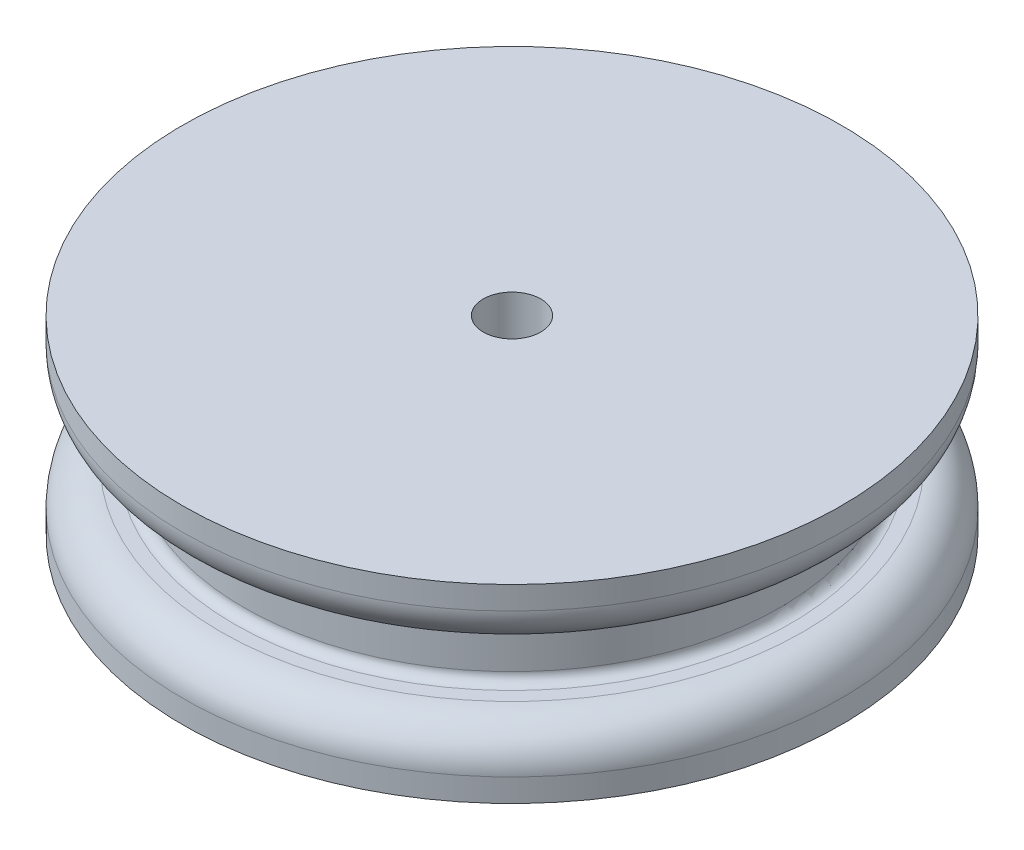
ISO-10303-21;
HEADER;
FILE_DESCRIPTION(('STEP AP214'),'2;1');
FILE_NAME('part.step','',(''),(''),'','','');
FILE_SCHEMA(('AUTOMOTIVE_DESIGN { 1 0 10303 214 1 1 1 1 }'));
ENDSEC;
DATA;
#1=APPLICATION_CONTEXT('core data for automotive mechanical design processes');
#2=APPLICATION_PROTOCOL_DEFINITION('international standard','automotive_design',2000,#1);
#3=PRODUCT_CONTEXT('',#1,'mechanical');
#4=PRODUCT('Part','Part','',(#3));
#5=PRODUCT_RELATED_PRODUCT_CATEGORY('part','',(#4));
#6=PRODUCT_DEFINITION_FORMATION('','',#4);
#7=PRODUCT_DEFINITION_CONTEXT('part definition',#1,'design');
#8=PRODUCT_DEFINITION('design','',#6,#7);
#9=PRODUCT_DEFINITION_SHAPE('','',#8);
#10=(LENGTH_UNIT() NAMED_UNIT(*) SI_UNIT(.MILLI.,.METRE.));
#11=(NAMED_UNIT(*) PLANE_ANGLE_UNIT() SI_UNIT($,.RADIAN.));
#12=(NAMED_UNIT(*) SI_UNIT($,.STERADIAN.) SOLID_ANGLE_UNIT());
#13=UNCERTAINTY_MEASURE_WITH_UNIT(LENGTH_MEASURE(1.E-05),#10,'distance_accuracy_value','');
#14=(GEOMETRIC_REPRESENTATION_CONTEXT(3) GLOBAL_UNCERTAINTY_ASSIGNED_CONTEXT((#13)) GLOBAL_UNIT_ASSIGNED_CONTEXT((#10,
#11,#12)) REPRESENTATION_CONTEXT('',''));
#15=CARTESIAN_POINT('',(0.,0.,0.));
#16=DIRECTION('',(0.,0.,1.));
#17=DIRECTION('',(1.,0.,0.));
#18=AXIS2_PLACEMENT_3D('',#15,#16,#17);
#19=CARTESIAN_POINT('',(0.,3.5,0.));
#20=DIRECTION('',(0.,-1.,0.));
#21=DIRECTION('',(0.,0.,-1.));
#22=AXIS2_PLACEMENT_3D('',#19,#20,#21);
#23=CYLINDRICAL_SURFACE('',#22,14.);
#24=CARTESIAN_POINT('',(0.,3.,0.));
#25=DIRECTION('',(0.,1.,0.));
#26=DIRECTION('',(0.,0.,1.));
#27=AXIS2_PLACEMENT_3D('',#24,#25,#26);
#28=CIRCLE('',#27,14.);
#29=CARTESIAN_POINT('',(0.,3.,14.));
#30=VERTEX_POINT('',#29);
#31=EDGE_CURVE('E44',#30,#30,#28,.F.);
#32=ORIENTED_EDGE('',*,*,#31,.T.);
#33=EDGE_LOOP('',(#32));
#34=FACE_BOUND('',#33,.T.);
#35=CARTESIAN_POINT('',(0.,0.5,0.));
#36=DIRECTION('',(0.,-1.,0.));
#37=DIRECTION('',(0.,0.,-1.));
#38=AXIS2_PLACEMENT_3D('',#35,#36,#37);
#39=CIRCLE('',#38,14.);
#40=CARTESIAN_POINT('',(0.,0.5,-14.));
#41=VERTEX_POINT('',#40);
#42=EDGE_CURVE('E48',#41,#41,#39,.F.);
#43=ORIENTED_EDGE('',*,*,#42,.T.);
#44=EDGE_LOOP('',(#43));
#45=FACE_BOUND('',#44,.T.);
#46=ADVANCED_FACE('F37',(#34,#45),#23,.T.);
#47=CARTESIAN_POINT('',(0.,6.7,0.));
#48=DIRECTION('',(0.,-1.,0.));
#49=DIRECTION('',(0.,0.,-1.));
#50=AXIS2_PLACEMENT_3D('',#47,#48,#49);
#51=CYLINDRICAL_SURFACE('',#50,17.2);
#52=CARTESIAN_POINT('',(0.,5.5,0.));
#53=DIRECTION('',(0.,1.,0.));
#54=DIRECTION('',(0.,0.,1.));
#55=AXIS2_PLACEMENT_3D('',#52,#53,#54);
#56=CIRCLE('',#55,17.2);
#57=CARTESIAN_POINT('',(0.,5.5,17.2));
#58=VERTEX_POINT('',#57);
#59=EDGE_CURVE('E66',#58,#58,#56,.T.);
#60=ORIENTED_EDGE('',*,*,#59,.T.);
#61=EDGE_LOOP('',(#60));
#62=FACE_BOUND('',#61,.T.);
#63=CARTESIAN_POINT('',(0.,6.7,0.));
#64=DIRECTION('',(0.,1.,0.));
#65=DIRECTION('',(0.,0.,1.));
#66=AXIS2_PLACEMENT_3D('',#63,#64,#65);
#67=CIRCLE('',#66,17.2);
#68=CARTESIAN_POINT('',(0.,6.7,17.2));
#69=VERTEX_POINT('',#68);
#70=EDGE_CURVE('E69',#69,#69,#67,.T.);
#71=ORIENTED_EDGE('',*,*,#70,.F.);
#72=EDGE_LOOP('',(#71));
#73=FACE_BOUND('',#72,.T.);
#74=ADVANCED_FACE('F114',(#62,#73),#51,.T.);
#75=CARTESIAN_POINT('',(0.,6.7,0.));
#76=DIRECTION('',(0.,1.,0.));
#77=DIRECTION('',(0.,0.,1.));
#78=AXIS2_PLACEMENT_3D('',#75,#76,#77);
#79=PLANE('',#78);
#80=CARTESIAN_POINT('',(0.,6.7,0.));
#81=DIRECTION('',(0.,-1.,0.));
#82=DIRECTION('',(0.,0.,-1.));
#83=AXIS2_PLACEMENT_3D('',#80,#81,#82);
#84=CIRCLE('',#83,1.5);
#85=CARTESIAN_POINT('',(0.,6.7,-1.5));
#86=VERTEX_POINT('',#85);
#87=EDGE_CURVE('E75',#86,#86,#84,.T.);
#88=ORIENTED_EDGE('',*,*,#87,.T.);
#89=EDGE_LOOP('',(#88));
#90=FACE_BOUND('',#89,.T.);
#91=ORIENTED_EDGE('',*,*,#70,.T.);
#92=EDGE_LOOP('',(#91));
#93=FACE_BOUND('',#92,.T.);
#94=ADVANCED_FACE('F82',(#90,#93),#79,.T.);
#95=CARTESIAN_POINT('',(0.,3.5,0.));
#96=DIRECTION('',(0.,1.,0.));
#97=DIRECTION('',(0.,0.,1.));
#98=AXIS2_PLACEMENT_3D('',#95,#96,#97);
#99=PLANE('',#98);
#100=CARTESIAN_POINT('',(0.,3.5,0.));
#101=DIRECTION('',(0.,1.,0.));
#102=DIRECTION('',(0.,0.,1.));
#103=AXIS2_PLACEMENT_3D('',#100,#101,#102);
#104=CIRCLE('',#103,14.5);
#105=CARTESIAN_POINT('',(0.,3.5,14.5));
#106=VERTEX_POINT('',#105);
#107=EDGE_CURVE('E52',#106,#106,#104,.T.);
#108=ORIENTED_EDGE('',*,*,#107,.T.);
#109=EDGE_LOOP('',(#108));
#110=FACE_BOUND('',#109,.T.);
#111=CARTESIAN_POINT('',(0.,3.5,0.));
#112=DIRECTION('',(0.,1.,0.));
#113=DIRECTION('',(0.,0.,1.));
#114=AXIS2_PLACEMENT_3D('',#111,#112,#113);
#115=CIRCLE('',#114,15.2);
#116=CARTESIAN_POINT('',(0.,3.5,15.2));
#117=VERTEX_POINT('',#116);
#118=EDGE_CURVE('E63',#117,#117,#115,.F.);
#119=ORIENTED_EDGE('',*,*,#118,.T.);
#120=EDGE_LOOP('',(#119));
#121=FACE_BOUND('',#120,.T.);
#122=ADVANCED_FACE('F101',(#110,#121),#99,.F.);
#123=CARTESIAN_POINT('',(0.,-3.2,0.));
#124=DIRECTION('',(0.,1.,0.));
#125=DIRECTION('',(0.,0.,1.));
#126=AXIS2_PLACEMENT_3D('',#123,#124,#125);
#127=CYLINDRICAL_SURFACE('',#126,17.2);
#128=CARTESIAN_POINT('',(0.,-2.,0.));
#129=DIRECTION('',(0.,-1.,0.));
#130=DIRECTION('',(0.,0.,-1.));
#131=AXIS2_PLACEMENT_3D('',#128,#129,#130);
#132=CIRCLE('',#131,17.2);
#133=CARTESIAN_POINT('',(0.,-2.,-17.2));
#134=VERTEX_POINT('',#133);
#135=EDGE_CURVE('E60',#134,#134,#132,.T.);
#136=ORIENTED_EDGE('',*,*,#135,.T.);
#137=EDGE_LOOP('',(#136));
#138=FACE_BOUND('',#137,.T.);
#139=CARTESIAN_POINT('',(0.,-3.2,0.));
#140=DIRECTION('',(0.,-1.,0.));
#141=DIRECTION('',(0.,0.,-1.));
#142=AXIS2_PLACEMENT_3D('',#139,#140,#141);
#143=CIRCLE('',#142,17.2);
#144=CARTESIAN_POINT('',(0.,-3.2,-17.2));
#145=VERTEX_POINT('',#144);
#146=EDGE_CURVE('E72',#145,#145,#143,.T.);
#147=ORIENTED_EDGE('',*,*,#146,.F.);
#148=EDGE_LOOP('',(#147));
#149=FACE_BOUND('',#148,.T.);
#150=ADVANCED_FACE('F96',(#138,#149),#127,.T.);
#151=CARTESIAN_POINT('',(0.,-3.2,0.));
#152=DIRECTION('',(0.,-1.,0.));
#153=DIRECTION('',(0.,0.,-1.));
#154=AXIS2_PLACEMENT_3D('',#151,#152,#153);
#155=PLANE('',#154);
#156=CARTESIAN_POINT('',(0.,-3.2,0.));
#157=DIRECTION('',(0.,-1.,0.));
#158=DIRECTION('',(0.,0.,-1.));
#159=AXIS2_PLACEMENT_3D('',#156,#157,#158);
#160=CIRCLE('',#159,1.5);
#161=CARTESIAN_POINT('',(0.,-3.2,-1.5));
#162=VERTEX_POINT('',#161);
#163=EDGE_CURVE('E76',#162,#162,#160,.T.);
#164=ORIENTED_EDGE('',*,*,#163,.F.);
#165=EDGE_LOOP('',(#164));
#166=FACE_BOUND('',#165,.T.);
#167=ORIENTED_EDGE('',*,*,#146,.T.);
#168=EDGE_LOOP('',(#167));
#169=FACE_BOUND('',#168,.T.);
#170=ADVANCED_FACE('F93',(#166,#169),#155,.T.);
#171=CARTESIAN_POINT('',(0.,0.,0.));
#172=DIRECTION('',(0.,-1.,0.));
#173=DIRECTION('',(0.,0.,-1.));
#174=AXIS2_PLACEMENT_3D('',#171,#172,#173);
#175=PLANE('',#174);
#176=CARTESIAN_POINT('',(0.,0.,0.));
#177=DIRECTION('',(0.,-1.,0.));
#178=DIRECTION('',(0.,0.,-1.));
#179=AXIS2_PLACEMENT_3D('',#176,#177,#178);
#180=CIRCLE('',#179,14.5);
#181=CARTESIAN_POINT('',(0.,0.,-14.5));
#182=VERTEX_POINT('',#181);
#183=EDGE_CURVE('E10',#182,#182,#180,.T.);
#184=ORIENTED_EDGE('',*,*,#183,.T.);
#185=EDGE_LOOP('',(#184));
#186=FACE_BOUND('',#185,.T.);
#187=CARTESIAN_POINT('',(0.,0.,0.));
#188=DIRECTION('',(0.,-1.,0.));
#189=DIRECTION('',(0.,0.,-1.));
#190=AXIS2_PLACEMENT_3D('',#187,#188,#189);
#191=CIRCLE('',#190,15.2);
#192=CARTESIAN_POINT('',(0.,0.,-15.2));
#193=VERTEX_POINT('',#192);
#194=EDGE_CURVE('E57',#193,#193,#191,.F.);
#195=ORIENTED_EDGE('',*,*,#194,.T.);
#196=EDGE_LOOP('',(#195));
#197=FACE_BOUND('',#196,.T.);
#198=ADVANCED_FACE('F89',(#186,#197),#175,.F.);
#199=CARTESIAN_POINT('',(0.,6.7,0.));
#200=DIRECTION('',(0.,-1.,0.));
#201=DIRECTION('',(0.,0.,-1.));
#202=AXIS2_PLACEMENT_3D('',#199,#200,#201);
#203=CYLINDRICAL_SURFACE('',#202,1.5);
#204=ORIENTED_EDGE('',*,*,#87,.F.);
#205=EDGE_LOOP('',(#204));
#206=FACE_BOUND('',#205,.T.);
#207=ORIENTED_EDGE('',*,*,#163,.T.);
#208=EDGE_LOOP('',(#207));
#209=FACE_BOUND('',#208,.T.);
#210=ADVANCED_FACE('F85',(#206,#209),#203,.F.);
#211=CARTESIAN_POINT('',(0.,5.5,0.));
#212=DIRECTION('',(0.,1.,0.));
#213=DIRECTION('',(0.,0.,1.));
#214=AXIS2_PLACEMENT_3D('',#211,#212,#213);
#215=TOROIDAL_SURFACE('',#214,15.2,2.);
#216=ORIENTED_EDGE('',*,*,#118,.F.);
#217=EDGE_LOOP('',(#216));
#218=FACE_BOUND('',#217,.T.);
#219=ORIENTED_EDGE('',*,*,#59,.F.);
#220=EDGE_LOOP('',(#219));
#221=FACE_BOUND('',#220,.T.);
#222=ADVANCED_FACE('F88',(#218,#221),#215,.T.);
#223=CARTESIAN_POINT('',(0.,-2.,0.));
#224=DIRECTION('',(0.,-1.,0.));
#225=DIRECTION('',(0.,0.,-1.));
#226=AXIS2_PLACEMENT_3D('',#223,#224,#225);
#227=TOROIDAL_SURFACE('',#226,15.2,2.);
#228=ORIENTED_EDGE('',*,*,#194,.F.);
#229=EDGE_LOOP('',(#228));
#230=FACE_BOUND('',#229,.T.);
#231=ORIENTED_EDGE('',*,*,#135,.F.);
#232=EDGE_LOOP('',(#231));
#233=FACE_BOUND('',#232,.T.);
#234=ADVANCED_FACE('F124',(#230,#233),#227,.T.);
#235=CARTESIAN_POINT('',(0.,3.,0.));
#236=DIRECTION('',(0.,1.,0.));
#237=DIRECTION('',(0.,0.,1.));
#238=AXIS2_PLACEMENT_3D('',#235,#236,#237);
#239=TOROIDAL_SURFACE('',#238,14.5,0.5);
#240=ORIENTED_EDGE('',*,*,#31,.F.);
#241=EDGE_LOOP('',(#240));
#242=FACE_BOUND('',#241,.T.);
#243=ORIENTED_EDGE('',*,*,#107,.F.);
#244=EDGE_LOOP('',(#243));
#245=FACE_BOUND('',#244,.T.);
#246=ADVANCED_FACE('F126',(#242,#245),#239,.F.);
#247=CARTESIAN_POINT('',(0.,0.5,0.));
#248=DIRECTION('',(0.,-1.,0.));
#249=DIRECTION('',(0.,0.,-1.));
#250=AXIS2_PLACEMENT_3D('',#247,#248,#249);
#251=TOROIDAL_SURFACE('',#250,14.5,0.5);
#252=ORIENTED_EDGE('',*,*,#183,.F.);
#253=EDGE_LOOP('',(#252));
#254=FACE_BOUND('',#253,.T.);
#255=ORIENTED_EDGE('',*,*,#42,.F.);
#256=EDGE_LOOP('',(#255));
#257=FACE_BOUND('',#256,.T.);
#258=ADVANCED_FACE('F39',(#254,#257),#251,.F.);
#259=CLOSED_SHELL('',(#46,#74,#94,#122,#150,#170,#198,#210,#222,#234,#246,#258));
#260=MANIFOLD_SOLID_BREP('B2',#259);
#261=ADVANCED_BREP_SHAPE_REPRESENTATION('',(#18,#260),#14);
#262=SHAPE_DEFINITION_REPRESENTATION(#9,#261);
ENDSEC;
END-ISO-10303-21;
